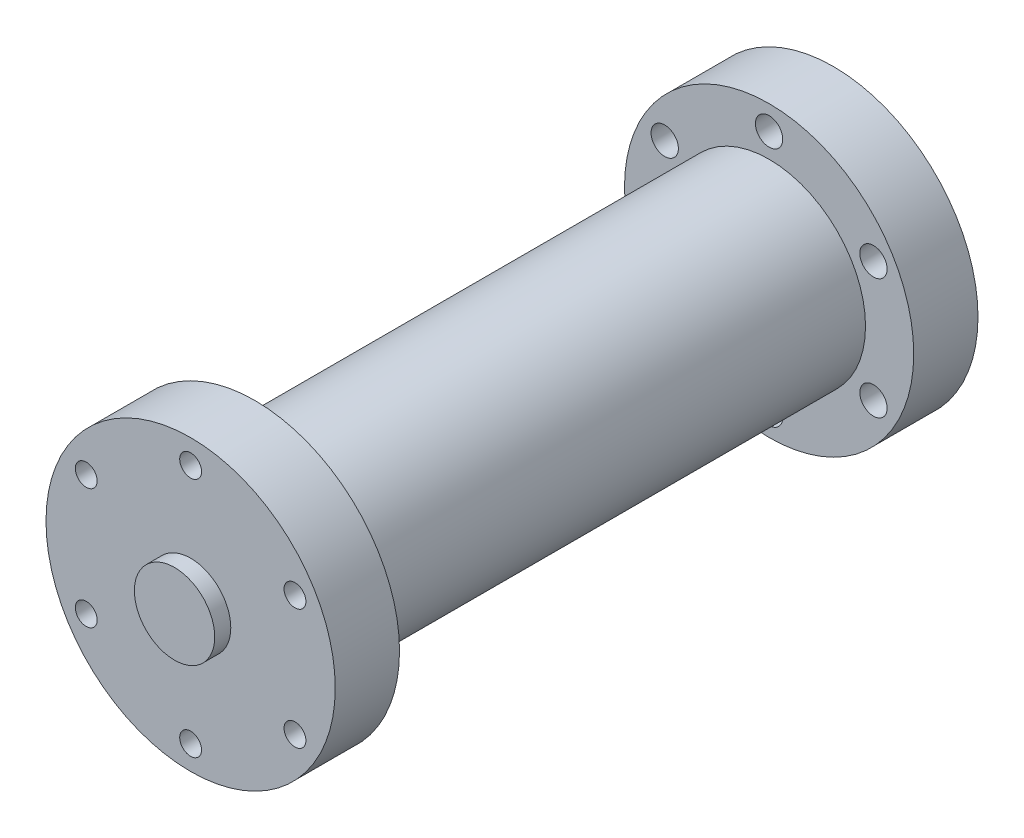
ISO-10303-21;
HEADER;
FILE_DESCRIPTION(('STEP AP214'),'2;1');
FILE_NAME('part.step','',(''),(''),'','','');
FILE_SCHEMA(('AUTOMOTIVE_DESIGN { 1 0 10303 214 1 1 1 1 }'));
ENDSEC;
DATA;
#1=APPLICATION_CONTEXT('core data for automotive mechanical design processes');
#2=APPLICATION_PROTOCOL_DEFINITION('international standard','automotive_design',2000,#1);
#3=PRODUCT_CONTEXT('',#1,'mechanical');
#4=PRODUCT('Part','Part','',(#3));
#5=PRODUCT_RELATED_PRODUCT_CATEGORY('part','',(#4));
#6=PRODUCT_DEFINITION_FORMATION('','',#4);
#7=PRODUCT_DEFINITION_CONTEXT('part definition',#1,'design');
#8=PRODUCT_DEFINITION('design','',#6,#7);
#9=PRODUCT_DEFINITION_SHAPE('','',#8);
#10=(LENGTH_UNIT() NAMED_UNIT(*) SI_UNIT(.MILLI.,.METRE.));
#11=(NAMED_UNIT(*) PLANE_ANGLE_UNIT() SI_UNIT($,.RADIAN.));
#12=(NAMED_UNIT(*) SI_UNIT($,.STERADIAN.) SOLID_ANGLE_UNIT());
#13=UNCERTAINTY_MEASURE_WITH_UNIT(LENGTH_MEASURE(1.E-05),#10,'distance_accuracy_value','');
#14=(GEOMETRIC_REPRESENTATION_CONTEXT(3) GLOBAL_UNCERTAINTY_ASSIGNED_CONTEXT((#13)) GLOBAL_UNIT_ASSIGNED_CONTEXT((#10,
#11,#12)) REPRESENTATION_CONTEXT('',''));
#15=CARTESIAN_POINT('',(0.,0.,0.));
#16=DIRECTION('',(0.,0.,1.));
#17=DIRECTION('',(1.,0.,0.));
#18=AXIS2_PLACEMENT_3D('',#15,#16,#17);
#19=CARTESIAN_POINT('',(0.,0.,20.));
#20=DIRECTION('',(0.,0.,-1.));
#21=DIRECTION('',(-1.,0.,0.));
#22=AXIS2_PLACEMENT_3D('',#19,#20,#21);
#23=CYLINDRICAL_SURFACE('',#22,45.);
#24=CARTESIAN_POINT('',(0.,0.,20.));
#25=DIRECTION('',(0.,0.,1.));
#26=DIRECTION('',(1.,0.,0.));
#27=AXIS2_PLACEMENT_3D('',#24,#25,#26);
#28=CIRCLE('',#27,45.);
#29=CARTESIAN_POINT('',(45.,0.,20.));
#30=VERTEX_POINT('',#29);
#31=EDGE_CURVE('E63',#30,#30,#28,.T.);
#32=ORIENTED_EDGE('',*,*,#31,.F.);
#33=EDGE_LOOP('',(#32));
#34=FACE_BOUND('',#33,.T.);
#35=CARTESIAN_POINT('',(0.,0.,0.));
#36=DIRECTION('',(0.,0.,1.));
#37=DIRECTION('',(1.,0.,0.));
#38=AXIS2_PLACEMENT_3D('',#35,#36,#37);
#39=CIRCLE('',#38,45.);
#40=CARTESIAN_POINT('',(45.,0.,0.));
#41=VERTEX_POINT('',#40);
#42=EDGE_CURVE('E52',#41,#41,#39,.T.);
#43=ORIENTED_EDGE('',*,*,#42,.T.);
#44=EDGE_LOOP('',(#43));
#45=FACE_BOUND('',#44,.T.);
#46=ADVANCED_FACE('F49',(#34,#45),#23,.T.);
#47=CARTESIAN_POINT('',(0.,0.,20.));
#48=DIRECTION('',(0.,0.,1.));
#49=DIRECTION('',(1.,0.,0.));
#50=AXIS2_PLACEMENT_3D('',#47,#48,#49);
#51=PLANE('',#50);
#52=CARTESIAN_POINT('',(32.4759526419162,18.7500000000004,20.));
#53=DIRECTION('',(0.,0.,1.));
#54=DIRECTION('',(1.,0.,0.));
#55=AXIS2_PLACEMENT_3D('',#52,#53,#54);
#56=CIRCLE('',#55,3.4);
#57=CARTESIAN_POINT('',(35.8759526419162,18.7500000000004,20.));
#58=VERTEX_POINT('',#57);
#59=EDGE_CURVE('E370',#58,#58,#56,.T.);
#60=ORIENTED_EDGE('',*,*,#59,.F.);
#61=EDGE_LOOP('',(#60));
#62=FACE_BOUND('',#61,.T.);
#63=CARTESIAN_POINT('',(32.4759526419166,-18.7499999999997,20.));
#64=DIRECTION('',(0.,0.,1.));
#65=DIRECTION('',(1.,0.,0.));
#66=AXIS2_PLACEMENT_3D('',#63,#64,#65);
#67=CIRCLE('',#66,3.4);
#68=CARTESIAN_POINT('',(35.8759526419166,-18.7499999999997,20.));
#69=VERTEX_POINT('',#68);
#70=EDGE_CURVE('E363',#69,#69,#67,.T.);
#71=ORIENTED_EDGE('',*,*,#70,.F.);
#72=EDGE_LOOP('',(#71));
#73=FACE_BOUND('',#72,.T.);
#74=CARTESIAN_POINT('',(0.,-37.5,20.));
#75=DIRECTION('',(0.,0.,1.));
#76=DIRECTION('',(1.,0.,0.));
#77=AXIS2_PLACEMENT_3D('',#74,#75,#76);
#78=CIRCLE('',#77,3.4);
#79=CARTESIAN_POINT('',(3.4,-37.5,20.));
#80=VERTEX_POINT('',#79);
#81=EDGE_CURVE('E355',#80,#80,#78,.T.);
#82=ORIENTED_EDGE('',*,*,#81,.F.);
#83=EDGE_LOOP('',(#82));
#84=FACE_BOUND('',#83,.T.);
#85=CARTESIAN_POINT('',(-32.4759526419164,-18.7500000000002,20.));
#86=DIRECTION('',(0.,0.,1.));
#87=DIRECTION('',(1.,0.,0.));
#88=AXIS2_PLACEMENT_3D('',#85,#86,#87);
#89=CIRCLE('',#88,3.4);
#90=CARTESIAN_POINT('',(-29.0759526419164,-18.7500000000002,20.));
#91=VERTEX_POINT('',#90);
#92=EDGE_CURVE('E347',#91,#91,#89,.T.);
#93=ORIENTED_EDGE('',*,*,#92,.F.);
#94=EDGE_LOOP('',(#93));
#95=FACE_BOUND('',#94,.T.);
#96=CARTESIAN_POINT('',(-32.4759526419165,18.7499999999999,20.));
#97=DIRECTION('',(0.,0.,1.));
#98=DIRECTION('',(1.,0.,0.));
#99=AXIS2_PLACEMENT_3D('',#96,#97,#98);
#100=CIRCLE('',#99,3.4);
#101=CARTESIAN_POINT('',(-29.0759526419165,18.7499999999999,20.));
#102=VERTEX_POINT('',#101);
#103=EDGE_CURVE('E339',#102,#102,#100,.T.);
#104=ORIENTED_EDGE('',*,*,#103,.F.);
#105=EDGE_LOOP('',(#104));
#106=FACE_BOUND('',#105,.T.);
#107=CARTESIAN_POINT('',(0.,37.5,20.));
#108=DIRECTION('',(0.,0.,1.));
#109=DIRECTION('',(1.,0.,0.));
#110=AXIS2_PLACEMENT_3D('',#107,#108,#109);
#111=CIRCLE('',#110,3.4);
#112=CARTESIAN_POINT('',(3.4,37.5,20.));
#113=VERTEX_POINT('',#112);
#114=EDGE_CURVE('E328',#113,#113,#111,.T.);
#115=ORIENTED_EDGE('',*,*,#114,.F.);
#116=EDGE_LOOP('',(#115));
#117=FACE_BOUND('',#116,.T.);
#118=CARTESIAN_POINT('',(0.,0.,20.));
#119=DIRECTION('',(0.,0.,1.));
#120=DIRECTION('',(1.,0.,0.));
#121=AXIS2_PLACEMENT_3D('',#118,#119,#120);
#122=CIRCLE('',#121,12.5);
#123=CARTESIAN_POINT('',(12.5,0.,20.));
#124=VERTEX_POINT('',#123);
#125=EDGE_CURVE('E12',#124,#124,#122,.T.);
#126=ORIENTED_EDGE('',*,*,#125,.F.);
#127=EDGE_LOOP('',(#126));
#128=FACE_BOUND('',#127,.T.);
#129=ORIENTED_EDGE('',*,*,#31,.T.);
#130=EDGE_LOOP('',(#129));
#131=FACE_BOUND('',#130,.T.);
#132=ADVANCED_FACE('F92',(#62,#73,#84,#95,#106,#117,#128,#131),#51,.T.);
#133=CARTESIAN_POINT('',(0.,0.,0.));
#134=DIRECTION('',(0.,0.,1.));
#135=DIRECTION('',(1.,0.,0.));
#136=AXIS2_PLACEMENT_3D('',#133,#134,#135);
#137=PLANE('',#136);
#138=CARTESIAN_POINT('',(32.4759526419162,18.7500000000004,0.));
#139=DIRECTION('',(0.,0.,1.));
#140=DIRECTION('',(1.,0.,0.));
#141=AXIS2_PLACEMENT_3D('',#138,#139,#140);
#142=CIRCLE('',#141,3.39999999999999);
#143=CARTESIAN_POINT('',(35.8759526419162,18.7500000000004,0.));
#144=VERTEX_POINT('',#143);
#145=EDGE_CURVE('E367',#144,#144,#142,.T.);
#146=ORIENTED_EDGE('',*,*,#145,.T.);
#147=EDGE_LOOP('',(#146));
#148=FACE_BOUND('',#147,.T.);
#149=CARTESIAN_POINT('',(32.4759526419166,-18.7499999999997,0.));
#150=DIRECTION('',(0.,0.,1.));
#151=DIRECTION('',(1.,0.,0.));
#152=AXIS2_PLACEMENT_3D('',#149,#150,#151);
#153=CIRCLE('',#152,3.39999999999999);
#154=CARTESIAN_POINT('',(35.8759526419166,-18.7499999999997,0.));
#155=VERTEX_POINT('',#154);
#156=EDGE_CURVE('E359',#155,#155,#153,.T.);
#157=ORIENTED_EDGE('',*,*,#156,.T.);
#158=EDGE_LOOP('',(#157));
#159=FACE_BOUND('',#158,.T.);
#160=CARTESIAN_POINT('',(0.,-37.5,0.));
#161=DIRECTION('',(0.,0.,1.));
#162=DIRECTION('',(1.,0.,0.));
#163=AXIS2_PLACEMENT_3D('',#160,#161,#162);
#164=CIRCLE('',#163,3.39999999999999);
#165=CARTESIAN_POINT('',(3.39999999999999,-37.5,0.));
#166=VERTEX_POINT('',#165);
#167=EDGE_CURVE('E351',#166,#166,#164,.T.);
#168=ORIENTED_EDGE('',*,*,#167,.T.);
#169=EDGE_LOOP('',(#168));
#170=FACE_BOUND('',#169,.T.);
#171=CARTESIAN_POINT('',(-32.4759526419164,-18.7500000000002,0.));
#172=DIRECTION('',(0.,0.,1.));
#173=DIRECTION('',(1.,0.,0.));
#174=AXIS2_PLACEMENT_3D('',#171,#172,#173);
#175=CIRCLE('',#174,3.39999999999998);
#176=CARTESIAN_POINT('',(-29.0759526419164,-18.7500000000002,0.));
#177=VERTEX_POINT('',#176);
#178=EDGE_CURVE('E343',#177,#177,#175,.T.);
#179=ORIENTED_EDGE('',*,*,#178,.T.);
#180=EDGE_LOOP('',(#179));
#181=FACE_BOUND('',#180,.T.);
#182=CARTESIAN_POINT('',(-32.4759526419165,18.7499999999999,0.));
#183=DIRECTION('',(0.,0.,1.));
#184=DIRECTION('',(1.,0.,0.));
#185=AXIS2_PLACEMENT_3D('',#182,#183,#184);
#186=CIRCLE('',#185,3.4);
#187=CARTESIAN_POINT('',(-29.0759526419165,18.7499999999999,0.));
#188=VERTEX_POINT('',#187);
#189=EDGE_CURVE('E333',#188,#188,#186,.T.);
#190=ORIENTED_EDGE('',*,*,#189,.T.);
#191=EDGE_LOOP('',(#190));
#192=FACE_BOUND('',#191,.T.);
#193=CARTESIAN_POINT('',(0.,37.5,0.));
#194=DIRECTION('',(0.,0.,1.));
#195=DIRECTION('',(1.,0.,0.));
#196=AXIS2_PLACEMENT_3D('',#193,#194,#195);
#197=CIRCLE('',#196,3.4);
#198=CARTESIAN_POINT('',(3.4,37.5,0.));
#199=VERTEX_POINT('',#198);
#200=EDGE_CURVE('E325',#199,#199,#197,.T.);
#201=ORIENTED_EDGE('',*,*,#200,.T.);
#202=EDGE_LOOP('',(#201));
#203=FACE_BOUND('',#202,.T.);
#204=CARTESIAN_POINT('',(0.,0.,0.));
#205=DIRECTION('',(0.,0.,-1.));
#206=DIRECTION('',(-1.,0.,0.));
#207=AXIS2_PLACEMENT_3D('',#204,#205,#206);
#208=CIRCLE('',#207,30.);
#209=CARTESIAN_POINT('',(-30.,0.,0.));
#210=VERTEX_POINT('',#209);
#211=EDGE_CURVE('E57',#210,#210,#208,.T.);
#212=ORIENTED_EDGE('',*,*,#211,.F.);
#213=EDGE_LOOP('',(#212));
#214=FACE_BOUND('',#213,.T.);
#215=ORIENTED_EDGE('',*,*,#42,.F.);
#216=EDGE_LOOP('',(#215));
#217=FACE_BOUND('',#216,.T.);
#218=ADVANCED_FACE('F89',(#148,#159,#170,#181,#192,#203,#214,#217),#137,.F.);
#219=CARTESIAN_POINT('',(0.,0.,-160.));
#220=DIRECTION('',(0.,0.,1.));
#221=DIRECTION('',(1.,0.,0.));
#222=AXIS2_PLACEMENT_3D('',#219,#220,#221);
#223=CYLINDRICAL_SURFACE('',#222,30.);
#224=CARTESIAN_POINT('',(0.,0.,-160.));
#225=DIRECTION('',(0.,0.,-1.));
#226=DIRECTION('',(-1.,0.,0.));
#227=AXIS2_PLACEMENT_3D('',#224,#225,#226);
#228=CIRCLE('',#227,30.);
#229=CARTESIAN_POINT('',(-30.,0.,-160.));
#230=VERTEX_POINT('',#229);
#231=EDGE_CURVE('E73',#230,#230,#228,.T.);
#232=ORIENTED_EDGE('',*,*,#231,.F.);
#233=EDGE_LOOP('',(#232));
#234=FACE_BOUND('',#233,.T.);
#235=ORIENTED_EDGE('',*,*,#211,.T.);
#236=EDGE_LOOP('',(#235));
#237=FACE_BOUND('',#236,.T.);
#238=ADVANCED_FACE('F91',(#234,#237),#223,.T.);
#239=CARTESIAN_POINT('',(0.,0.,-180.));
#240=DIRECTION('',(0.,0.,1.));
#241=DIRECTION('',(1.,0.,0.));
#242=AXIS2_PLACEMENT_3D('',#239,#240,#241);
#243=CYLINDRICAL_SURFACE('',#242,45.);
#244=CARTESIAN_POINT('',(0.,0.,-180.));
#245=DIRECTION('',(0.,0.,-1.));
#246=DIRECTION('',(-1.,0.,0.));
#247=AXIS2_PLACEMENT_3D('',#244,#245,#246);
#248=CIRCLE('',#247,45.);
#249=CARTESIAN_POINT('',(-45.,0.,-180.));
#250=VERTEX_POINT('',#249);
#251=EDGE_CURVE('E69',#250,#250,#248,.T.);
#252=ORIENTED_EDGE('',*,*,#251,.F.);
#253=EDGE_LOOP('',(#252));
#254=FACE_BOUND('',#253,.T.);
#255=CARTESIAN_POINT('',(0.,0.,-160.));
#256=DIRECTION('',(0.,0.,-1.));
#257=DIRECTION('',(-1.,0.,0.));
#258=AXIS2_PLACEMENT_3D('',#255,#256,#257);
#259=CIRCLE('',#258,45.);
#260=CARTESIAN_POINT('',(-45.,0.,-160.));
#261=VERTEX_POINT('',#260);
#262=EDGE_CURVE('E74',#261,#261,#259,.T.);
#263=ORIENTED_EDGE('',*,*,#262,.T.);
#264=EDGE_LOOP('',(#263));
#265=FACE_BOUND('',#264,.T.);
#266=ADVANCED_FACE('F98',(#254,#265),#243,.T.);
#267=CARTESIAN_POINT('',(0.,0.,-180.));
#268=DIRECTION('',(0.,0.,-1.));
#269=DIRECTION('',(-1.,0.,0.));
#270=AXIS2_PLACEMENT_3D('',#267,#268,#269);
#271=PLANE('',#270);
#272=CARTESIAN_POINT('',(0.,0.,-180.));
#273=DIRECTION('',(0.,0.,-1.));
#274=DIRECTION('',(-1.,0.,0.));
#275=AXIS2_PLACEMENT_3D('',#272,#273,#274);
#276=CIRCLE('',#275,12.5);
#277=CARTESIAN_POINT('',(-12.5,0.,-180.));
#278=VERTEX_POINT('',#277);
#279=EDGE_CURVE('E423',#278,#278,#276,.T.);
#280=ORIENTED_EDGE('',*,*,#279,.F.);
#281=EDGE_LOOP('',(#280));
#282=FACE_BOUND('',#281,.T.);
#283=CARTESIAN_POINT('',(-32.4759526419162,18.7500000000004,-180.));
#284=DIRECTION('',(0.,0.,-1.));
#285=DIRECTION('',(-1.,0.,0.));
#286=AXIS2_PLACEMENT_3D('',#283,#284,#285);
#287=CIRCLE('',#286,4.25);
#288=CARTESIAN_POINT('',(-36.7259526419162,18.7500000000004,-180.));
#289=VERTEX_POINT('',#288);
#290=EDGE_CURVE('E418',#289,#289,#287,.T.);
#291=ORIENTED_EDGE('',*,*,#290,.F.);
#292=EDGE_LOOP('',(#291));
#293=FACE_BOUND('',#292,.T.);
#294=CARTESIAN_POINT('',(-32.4759526419166,-18.7499999999997,-180.));
#295=DIRECTION('',(0.,0.,-1.));
#296=DIRECTION('',(-1.,0.,0.));
#297=AXIS2_PLACEMENT_3D('',#294,#295,#296);
#298=CIRCLE('',#297,4.25);
#299=CARTESIAN_POINT('',(-36.7259526419166,-18.7499999999997,-180.));
#300=VERTEX_POINT('',#299);
#301=EDGE_CURVE('E410',#300,#300,#298,.T.);
#302=ORIENTED_EDGE('',*,*,#301,.F.);
#303=EDGE_LOOP('',(#302));
#304=FACE_BOUND('',#303,.T.);
#305=CARTESIAN_POINT('',(0.,-37.5,-180.));
#306=DIRECTION('',(0.,0.,-1.));
#307=DIRECTION('',(-1.,0.,0.));
#308=AXIS2_PLACEMENT_3D('',#305,#306,#307);
#309=CIRCLE('',#308,4.25);
#310=CARTESIAN_POINT('',(-4.25,-37.5,-180.));
#311=VERTEX_POINT('',#310);
#312=EDGE_CURVE('E402',#311,#311,#309,.T.);
#313=ORIENTED_EDGE('',*,*,#312,.F.);
#314=EDGE_LOOP('',(#313));
#315=FACE_BOUND('',#314,.T.);
#316=CARTESIAN_POINT('',(32.4759526419164,-18.7500000000002,-180.));
#317=DIRECTION('',(0.,0.,-1.));
#318=DIRECTION('',(-1.,0.,0.));
#319=AXIS2_PLACEMENT_3D('',#316,#317,#318);
#320=CIRCLE('',#319,4.25);
#321=CARTESIAN_POINT('',(28.2259526419164,-18.7500000000002,-180.));
#322=VERTEX_POINT('',#321);
#323=EDGE_CURVE('E394',#322,#322,#320,.T.);
#324=ORIENTED_EDGE('',*,*,#323,.F.);
#325=EDGE_LOOP('',(#324));
#326=FACE_BOUND('',#325,.T.);
#327=CARTESIAN_POINT('',(32.4759526419165,18.7499999999999,-180.));
#328=DIRECTION('',(0.,0.,-1.));
#329=DIRECTION('',(-1.,0.,0.));
#330=AXIS2_PLACEMENT_3D('',#327,#328,#329);
#331=CIRCLE('',#330,4.25);
#332=CARTESIAN_POINT('',(28.2259526419165,18.7499999999999,-180.));
#333=VERTEX_POINT('',#332);
#334=EDGE_CURVE('E386',#333,#333,#331,.T.);
#335=ORIENTED_EDGE('',*,*,#334,.F.);
#336=EDGE_LOOP('',(#335));
#337=FACE_BOUND('',#336,.T.);
#338=CARTESIAN_POINT('',(0.,37.5,-180.));
#339=DIRECTION('',(0.,0.,-1.));
#340=DIRECTION('',(-1.,0.,0.));
#341=AXIS2_PLACEMENT_3D('',#338,#339,#340);
#342=CIRCLE('',#341,4.25);
#343=CARTESIAN_POINT('',(-4.25,37.5,-180.));
#344=VERTEX_POINT('',#343);
#345=EDGE_CURVE('E378',#344,#344,#342,.T.);
#346=ORIENTED_EDGE('',*,*,#345,.F.);
#347=EDGE_LOOP('',(#346));
#348=FACE_BOUND('',#347,.T.);
#349=ORIENTED_EDGE('',*,*,#251,.T.);
#350=EDGE_LOOP('',(#349));
#351=FACE_BOUND('',#350,.T.);
#352=ADVANCED_FACE('F199',(#282,#293,#304,#315,#326,#337,#348,#351),#271,.T.);
#353=CARTESIAN_POINT('',(0.,0.,-160.));
#354=DIRECTION('',(0.,0.,-1.));
#355=DIRECTION('',(-1.,0.,0.));
#356=AXIS2_PLACEMENT_3D('',#353,#354,#355);
#357=PLANE('',#356);
#358=CARTESIAN_POINT('',(-32.4759526419162,18.7500000000004,-160.));
#359=DIRECTION('',(0.,0.,-1.));
#360=DIRECTION('',(-1.,0.,0.));
#361=AXIS2_PLACEMENT_3D('',#358,#359,#360);
#362=CIRCLE('',#361,4.25);
#363=CARTESIAN_POINT('',(-36.7259526419162,18.7500000000004,-160.));
#364=VERTEX_POINT('',#363);
#365=EDGE_CURVE('E414',#364,#364,#362,.T.);
#366=ORIENTED_EDGE('',*,*,#365,.T.);
#367=EDGE_LOOP('',(#366));
#368=FACE_BOUND('',#367,.T.);
#369=CARTESIAN_POINT('',(-32.4759526419166,-18.7499999999997,-160.));
#370=DIRECTION('',(0.,0.,-1.));
#371=DIRECTION('',(-1.,0.,0.));
#372=AXIS2_PLACEMENT_3D('',#369,#370,#371);
#373=CIRCLE('',#372,4.25);
#374=CARTESIAN_POINT('',(-36.7259526419166,-18.7499999999997,-160.));
#375=VERTEX_POINT('',#374);
#376=EDGE_CURVE('E406',#375,#375,#373,.T.);
#377=ORIENTED_EDGE('',*,*,#376,.T.);
#378=EDGE_LOOP('',(#377));
#379=FACE_BOUND('',#378,.T.);
#380=CARTESIAN_POINT('',(0.,-37.5,-160.));
#381=DIRECTION('',(0.,0.,-1.));
#382=DIRECTION('',(-1.,0.,0.));
#383=AXIS2_PLACEMENT_3D('',#380,#381,#382);
#384=CIRCLE('',#383,4.25);
#385=CARTESIAN_POINT('',(-4.25,-37.5,-160.));
#386=VERTEX_POINT('',#385);
#387=EDGE_CURVE('E398',#386,#386,#384,.T.);
#388=ORIENTED_EDGE('',*,*,#387,.T.);
#389=EDGE_LOOP('',(#388));
#390=FACE_BOUND('',#389,.T.);
#391=CARTESIAN_POINT('',(32.4759526419164,-18.7500000000002,-160.));
#392=DIRECTION('',(0.,0.,-1.));
#393=DIRECTION('',(-1.,0.,0.));
#394=AXIS2_PLACEMENT_3D('',#391,#392,#393);
#395=CIRCLE('',#394,4.25);
#396=CARTESIAN_POINT('',(28.2259526419164,-18.7500000000002,-160.));
#397=VERTEX_POINT('',#396);
#398=EDGE_CURVE('E390',#397,#397,#395,.T.);
#399=ORIENTED_EDGE('',*,*,#398,.T.);
#400=EDGE_LOOP('',(#399));
#401=FACE_BOUND('',#400,.T.);
#402=CARTESIAN_POINT('',(32.4759526419165,18.7499999999999,-160.));
#403=DIRECTION('',(0.,0.,-1.));
#404=DIRECTION('',(-1.,0.,0.));
#405=AXIS2_PLACEMENT_3D('',#402,#403,#404);
#406=CIRCLE('',#405,4.25);
#407=CARTESIAN_POINT('',(28.2259526419165,18.7499999999999,-160.));
#408=VERTEX_POINT('',#407);
#409=EDGE_CURVE('E382',#408,#408,#406,.T.);
#410=ORIENTED_EDGE('',*,*,#409,.T.);
#411=EDGE_LOOP('',(#410));
#412=FACE_BOUND('',#411,.T.);
#413=CARTESIAN_POINT('',(0.,37.5,-160.));
#414=DIRECTION('',(0.,0.,-1.));
#415=DIRECTION('',(-1.,0.,0.));
#416=AXIS2_PLACEMENT_3D('',#413,#414,#415);
#417=CIRCLE('',#416,4.25);
#418=CARTESIAN_POINT('',(-4.25,37.5,-160.));
#419=VERTEX_POINT('',#418);
#420=EDGE_CURVE('E374',#419,#419,#417,.T.);
#421=ORIENTED_EDGE('',*,*,#420,.T.);
#422=EDGE_LOOP('',(#421));
#423=FACE_BOUND('',#422,.T.);
#424=ORIENTED_EDGE('',*,*,#231,.T.);
#425=EDGE_LOOP('',(#424));
#426=FACE_BOUND('',#425,.T.);
#427=ORIENTED_EDGE('',*,*,#262,.F.);
#428=EDGE_LOOP('',(#427));
#429=FACE_BOUND('',#428,.T.);
#430=ADVANCED_FACE('F193',(#368,#379,#390,#401,#412,#423,#426,#429),#357,.F.);
#431=CARTESIAN_POINT('',(0.,0.,25.));
#432=DIRECTION('',(0.,0.,-1.));
#433=DIRECTION('',(-1.,0.,0.));
#434=AXIS2_PLACEMENT_3D('',#431,#432,#433);
#435=CYLINDRICAL_SURFACE('',#434,12.5);
#436=CARTESIAN_POINT('',(0.,0.,25.));
#437=DIRECTION('',(0.,0.,1.));
#438=DIRECTION('',(1.,0.,0.));
#439=AXIS2_PLACEMENT_3D('',#436,#437,#438);
#440=CIRCLE('',#439,12.5);
#441=CARTESIAN_POINT('',(12.5,0.,25.));
#442=VERTEX_POINT('',#441);
#443=EDGE_CURVE('E67',#442,#442,#440,.T.);
#444=ORIENTED_EDGE('',*,*,#443,.F.);
#445=EDGE_LOOP('',(#444));
#446=FACE_BOUND('',#445,.T.);
#447=ORIENTED_EDGE('',*,*,#125,.T.);
#448=EDGE_LOOP('',(#447));
#449=FACE_BOUND('',#448,.T.);
#450=ADVANCED_FACE('F198',(#446,#449),#435,.T.);
#451=CARTESIAN_POINT('',(0.,0.,25.));
#452=DIRECTION('',(0.,0.,1.));
#453=DIRECTION('',(1.,0.,0.));
#454=AXIS2_PLACEMENT_3D('',#451,#452,#453);
#455=PLANE('',#454);
#456=ORIENTED_EDGE('',*,*,#443,.T.);
#457=EDGE_LOOP('',(#456));
#458=FACE_BOUND('',#457,.T.);
#459=ADVANCED_FACE('F287',(#458),#455,.T.);
#460=CARTESIAN_POINT('',(0.,37.5,20.));
#461=DIRECTION('',(0.,0.,1.));
#462=DIRECTION('',(1.,0.,0.));
#463=AXIS2_PLACEMENT_3D('',#460,#461,#462);
#464=CYLINDRICAL_SURFACE('',#463,3.4);
#465=ORIENTED_EDGE('',*,*,#200,.F.);
#466=EDGE_LOOP('',(#465));
#467=FACE_BOUND('',#466,.T.);
#468=ORIENTED_EDGE('',*,*,#114,.T.);
#469=EDGE_LOOP('',(#468));
#470=FACE_BOUND('',#469,.T.);
#471=ADVANCED_FACE('F120',(#467,#470),#464,.F.);
#472=CARTESIAN_POINT('',(-32.4759526419165,18.7499999999999,20.));
#473=DIRECTION('',(0.,0.,1.));
#474=DIRECTION('',(1.,0.,0.));
#475=AXIS2_PLACEMENT_3D('',#472,#473,#474);
#476=CYLINDRICAL_SURFACE('',#475,3.4);
#477=ORIENTED_EDGE('',*,*,#189,.F.);
#478=EDGE_LOOP('',(#477));
#479=FACE_BOUND('',#478,.T.);
#480=ORIENTED_EDGE('',*,*,#103,.T.);
#481=EDGE_LOOP('',(#480));
#482=FACE_BOUND('',#481,.T.);
#483=ADVANCED_FACE('F130',(#479,#482),#476,.F.);
#484=CARTESIAN_POINT('',(-32.4759526419164,-18.7500000000002,20.));
#485=DIRECTION('',(0.,0.,1.));
#486=DIRECTION('',(1.,0.,0.));
#487=AXIS2_PLACEMENT_3D('',#484,#485,#486);
#488=CYLINDRICAL_SURFACE('',#487,3.39999999999998);
#489=ORIENTED_EDGE('',*,*,#178,.F.);
#490=EDGE_LOOP('',(#489));
#491=FACE_BOUND('',#490,.T.);
#492=ORIENTED_EDGE('',*,*,#92,.T.);
#493=EDGE_LOOP('',(#492));
#494=FACE_BOUND('',#493,.T.);
#495=ADVANCED_FACE('F135',(#491,#494),#488,.F.);
#496=CARTESIAN_POINT('',(0.,-37.5,20.));
#497=DIRECTION('',(0.,0.,1.));
#498=DIRECTION('',(1.,0.,0.));
#499=AXIS2_PLACEMENT_3D('',#496,#497,#498);
#500=CYLINDRICAL_SURFACE('',#499,3.39999999999999);
#501=ORIENTED_EDGE('',*,*,#167,.F.);
#502=EDGE_LOOP('',(#501));
#503=FACE_BOUND('',#502,.T.);
#504=ORIENTED_EDGE('',*,*,#81,.T.);
#505=EDGE_LOOP('',(#504));
#506=FACE_BOUND('',#505,.T.);
#507=ADVANCED_FACE('F145',(#503,#506),#500,.F.);
#508=CARTESIAN_POINT('',(32.4759526419166,-18.7499999999997,20.));
#509=DIRECTION('',(0.,0.,1.));
#510=DIRECTION('',(1.,0.,0.));
#511=AXIS2_PLACEMENT_3D('',#508,#509,#510);
#512=CYLINDRICAL_SURFACE('',#511,3.39999999999999);
#513=ORIENTED_EDGE('',*,*,#156,.F.);
#514=EDGE_LOOP('',(#513));
#515=FACE_BOUND('',#514,.T.);
#516=ORIENTED_EDGE('',*,*,#70,.T.);
#517=EDGE_LOOP('',(#516));
#518=FACE_BOUND('',#517,.T.);
#519=ADVANCED_FACE('F155',(#515,#518),#512,.F.);
#520=CARTESIAN_POINT('',(32.4759526419162,18.7500000000004,20.));
#521=DIRECTION('',(0.,0.,1.));
#522=DIRECTION('',(1.,0.,0.));
#523=AXIS2_PLACEMENT_3D('',#520,#521,#522);
#524=CYLINDRICAL_SURFACE('',#523,3.39999999999999);
#525=ORIENTED_EDGE('',*,*,#145,.F.);
#526=EDGE_LOOP('',(#525));
#527=FACE_BOUND('',#526,.T.);
#528=ORIENTED_EDGE('',*,*,#59,.T.);
#529=EDGE_LOOP('',(#528));
#530=FACE_BOUND('',#529,.T.);
#531=ADVANCED_FACE('F165',(#527,#530),#524,.F.);
#532=CARTESIAN_POINT('',(0.,37.5,-180.));
#533=DIRECTION('',(0.,0.,-1.));
#534=DIRECTION('',(-1.,0.,0.));
#535=AXIS2_PLACEMENT_3D('',#532,#533,#534);
#536=CYLINDRICAL_SURFACE('',#535,4.25);
#537=ORIENTED_EDGE('',*,*,#420,.F.);
#538=EDGE_LOOP('',(#537));
#539=FACE_BOUND('',#538,.T.);
#540=ORIENTED_EDGE('',*,*,#345,.T.);
#541=EDGE_LOOP('',(#540));
#542=FACE_BOUND('',#541,.T.);
#543=ADVANCED_FACE('F175',(#539,#542),#536,.F.);
#544=CARTESIAN_POINT('',(32.4759526419165,18.7499999999999,-180.));
#545=DIRECTION('',(0.,0.,-1.));
#546=DIRECTION('',(-1.,0.,0.));
#547=AXIS2_PLACEMENT_3D('',#544,#545,#546);
#548=CYLINDRICAL_SURFACE('',#547,4.25);
#549=ORIENTED_EDGE('',*,*,#409,.F.);
#550=EDGE_LOOP('',(#549));
#551=FACE_BOUND('',#550,.T.);
#552=ORIENTED_EDGE('',*,*,#334,.T.);
#553=EDGE_LOOP('',(#552));
#554=FACE_BOUND('',#553,.T.);
#555=ADVANCED_FACE('F185',(#551,#554),#548,.F.);
#556=CARTESIAN_POINT('',(32.4759526419164,-18.7500000000002,-180.));
#557=DIRECTION('',(0.,0.,-1.));
#558=DIRECTION('',(-1.,0.,0.));
#559=AXIS2_PLACEMENT_3D('',#556,#557,#558);
#560=CYLINDRICAL_SURFACE('',#559,4.25);
#561=ORIENTED_EDGE('',*,*,#398,.F.);
#562=EDGE_LOOP('',(#561));
#563=FACE_BOUND('',#562,.T.);
#564=ORIENTED_EDGE('',*,*,#323,.T.);
#565=EDGE_LOOP('',(#564));
#566=FACE_BOUND('',#565,.T.);
#567=ADVANCED_FACE('F211',(#563,#566),#560,.F.);
#568=CARTESIAN_POINT('',(0.,-37.5,-180.));
#569=DIRECTION('',(0.,0.,-1.));
#570=DIRECTION('',(-1.,0.,0.));
#571=AXIS2_PLACEMENT_3D('',#568,#569,#570);
#572=CYLINDRICAL_SURFACE('',#571,4.25);
#573=ORIENTED_EDGE('',*,*,#387,.F.);
#574=EDGE_LOOP('',(#573));
#575=FACE_BOUND('',#574,.T.);
#576=ORIENTED_EDGE('',*,*,#312,.T.);
#577=EDGE_LOOP('',(#576));
#578=FACE_BOUND('',#577,.T.);
#579=ADVANCED_FACE('F221',(#575,#578),#572,.F.);
#580=CARTESIAN_POINT('',(-32.4759526419166,-18.7499999999997,-180.));
#581=DIRECTION('',(0.,0.,-1.));
#582=DIRECTION('',(-1.,0.,0.));
#583=AXIS2_PLACEMENT_3D('',#580,#581,#582);
#584=CYLINDRICAL_SURFACE('',#583,4.25);
#585=ORIENTED_EDGE('',*,*,#376,.F.);
#586=EDGE_LOOP('',(#585));
#587=FACE_BOUND('',#586,.T.);
#588=ORIENTED_EDGE('',*,*,#301,.T.);
#589=EDGE_LOOP('',(#588));
#590=FACE_BOUND('',#589,.T.);
#591=ADVANCED_FACE('F231',(#587,#590),#584,.F.);
#592=CARTESIAN_POINT('',(-32.4759526419162,18.7500000000004,-180.));
#593=DIRECTION('',(0.,0.,-1.));
#594=DIRECTION('',(-1.,0.,0.));
#595=AXIS2_PLACEMENT_3D('',#592,#593,#594);
#596=CYLINDRICAL_SURFACE('',#595,4.25);
#597=ORIENTED_EDGE('',*,*,#365,.F.);
#598=EDGE_LOOP('',(#597));
#599=FACE_BOUND('',#598,.T.);
#600=ORIENTED_EDGE('',*,*,#290,.T.);
#601=EDGE_LOOP('',(#600));
#602=FACE_BOUND('',#601,.T.);
#603=ADVANCED_FACE('F241',(#599,#602),#596,.F.);
#604=CARTESIAN_POINT('',(0.,0.,-160.));
#605=DIRECTION('',(0.,0.,-1.));
#606=DIRECTION('',(-1.,0.,0.));
#607=AXIS2_PLACEMENT_3D('',#604,#605,#606);
#608=CYLINDRICAL_SURFACE('',#607,12.5);
#609=CARTESIAN_POINT('',(0.,0.,-160.));
#610=DIRECTION('',(0.,0.,-1.));
#611=DIRECTION('',(-1.,0.,0.));
#612=AXIS2_PLACEMENT_3D('',#609,#610,#611);
#613=CIRCLE('',#612,12.5);
#614=CARTESIAN_POINT('',(-12.5,0.,-160.));
#615=VERTEX_POINT('',#614);
#616=EDGE_CURVE('E422',#615,#615,#613,.T.);
#617=ORIENTED_EDGE('',*,*,#616,.F.);
#618=EDGE_LOOP('',(#617));
#619=FACE_BOUND('',#618,.T.);
#620=ORIENTED_EDGE('',*,*,#279,.T.);
#621=EDGE_LOOP('',(#620));
#622=FACE_BOUND('',#621,.T.);
#623=ADVANCED_FACE('F251',(#619,#622),#608,.F.);
#624=CARTESIAN_POINT('',(0.,0.,-160.));
#625=DIRECTION('',(0.,0.,-1.));
#626=DIRECTION('',(-1.,0.,0.));
#627=AXIS2_PLACEMENT_3D('',#624,#625,#626);
#628=PLANE('',#627);
#629=ORIENTED_EDGE('',*,*,#616,.T.);
#630=EDGE_LOOP('',(#629));
#631=FACE_BOUND('',#630,.T.);
#632=ADVANCED_FACE('F270',(#631),#628,.T.);
#633=CLOSED_SHELL('',(#46,#132,#218,#238,#266,#352,#430,#450,#459,#471,#483,#495,#507,#519,#531,
#543,#555,#567,#579,#591,#603,#623,#632));
#634=MANIFOLD_SOLID_BREP('B2',#633);
#635=ADVANCED_BREP_SHAPE_REPRESENTATION('',(#18,#634),#14);
#636=SHAPE_DEFINITION_REPRESENTATION(#9,#635);
ENDSEC;
END-ISO-10303-21;
